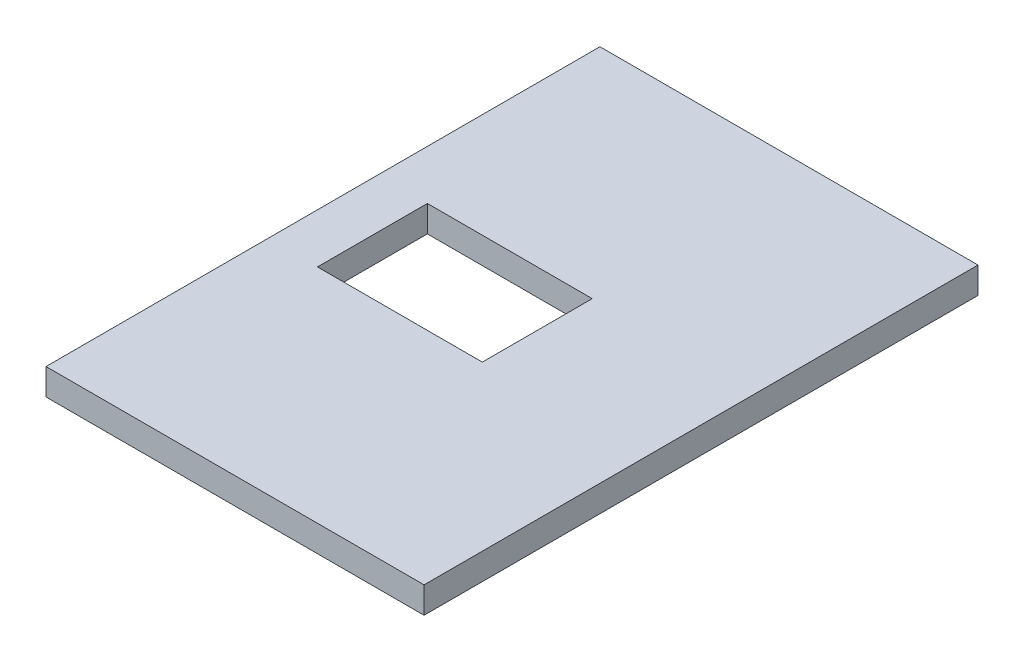
ISO-10303-21;
HEADER;
FILE_DESCRIPTION(('STEP AP214'),'2;1');
FILE_NAME('part.step','',(''),(''),'','','');
FILE_SCHEMA(('AUTOMOTIVE_DESIGN { 1 0 10303 214 1 1 1 1 }'));
ENDSEC;
DATA;
#1=APPLICATION_CONTEXT('core data for automotive mechanical design processes');
#2=APPLICATION_PROTOCOL_DEFINITION('international standard','automotive_design',2000,#1);
#3=PRODUCT_CONTEXT('',#1,'mechanical');
#4=PRODUCT('Part','Part','',(#3));
#5=PRODUCT_RELATED_PRODUCT_CATEGORY('part','',(#4));
#6=PRODUCT_DEFINITION_FORMATION('','',#4);
#7=PRODUCT_DEFINITION_CONTEXT('part definition',#1,'design');
#8=PRODUCT_DEFINITION('design','',#6,#7);
#9=PRODUCT_DEFINITION_SHAPE('','',#8);
#10=(LENGTH_UNIT() NAMED_UNIT(*) SI_UNIT(.MILLI.,.METRE.));
#11=(NAMED_UNIT(*) PLANE_ANGLE_UNIT() SI_UNIT($,.RADIAN.));
#12=(NAMED_UNIT(*) SI_UNIT($,.STERADIAN.) SOLID_ANGLE_UNIT());
#13=UNCERTAINTY_MEASURE_WITH_UNIT(LENGTH_MEASURE(1.E-05),#10,'distance_accuracy_value','');
#14=(GEOMETRIC_REPRESENTATION_CONTEXT(3) GLOBAL_UNCERTAINTY_ASSIGNED_CONTEXT((#13)) GLOBAL_UNIT_ASSIGNED_CONTEXT((#10,
#11,#12)) REPRESENTATION_CONTEXT('',''));
#15=CARTESIAN_POINT('',(0.,0.,0.));
#16=DIRECTION('',(0.,0.,1.));
#17=DIRECTION('',(1.,0.,0.));
#18=AXIS2_PLACEMENT_3D('',#15,#16,#17);
#19=CARTESIAN_POINT('',(810.,120.,1260.));
#20=DIRECTION('',(0.,0.,-1.));
#21=DIRECTION('',(-1.,0.,0.));
#22=AXIS2_PLACEMENT_3D('',#19,#20,#21);
#23=PLANE('',#22);
#24=DIRECTION('',(1.,0.,0.));
#25=VECTOR('',#24,1.);
#26=CARTESIAN_POINT('',(810.,0.,1260.));
#27=LINE('',#26,#25);
#28=CARTESIAN_POINT('',(-910.,0.,1260.));
#29=VERTEX_POINT('',#28);
#30=CARTESIAN_POINT('',(810.,0.,1260.));
#31=VERTEX_POINT('',#30);
#32=EDGE_CURVE('E114',#29,#31,#27,.T.);
#33=ORIENTED_EDGE('',*,*,#32,.T.);
#34=DIRECTION('',(0.,-1.,0.));
#35=VECTOR('',#34,1.);
#36=CARTESIAN_POINT('',(810.,120.,1260.));
#37=LINE('',#36,#35);
#38=CARTESIAN_POINT('',(810.,120.,1260.));
#39=VERTEX_POINT('',#38);
#40=EDGE_CURVE('E11',#39,#31,#37,.T.);
#41=ORIENTED_EDGE('',*,*,#40,.F.);
#42=DIRECTION('',(1.,0.,0.));
#43=VECTOR('',#42,1.);
#44=CARTESIAN_POINT('',(810.,120.,1260.));
#45=LINE('',#44,#43);
#46=CARTESIAN_POINT('',(-910.,120.,1260.));
#47=VERTEX_POINT('',#46);
#48=EDGE_CURVE('E108',#47,#39,#45,.T.);
#49=ORIENTED_EDGE('',*,*,#48,.F.);
#50=DIRECTION('',(0.,1.,0.));
#51=VECTOR('',#50,1.);
#52=CARTESIAN_POINT('',(-910.,120.,1260.));
#53=LINE('',#52,#51);
#54=EDGE_CURVE('E118',#29,#47,#53,.T.);
#55=ORIENTED_EDGE('',*,*,#54,.F.);
#56=EDGE_LOOP('',(#33,#41,#49,#55));
#57=FACE_BOUND('',#56,.T.);
#58=ADVANCED_FACE('F34',(#57),#23,.F.);
#59=CARTESIAN_POINT('',(810.,120.,-1260.));
#60=DIRECTION('',(-1.,0.,0.));
#61=DIRECTION('',(0.,0.,1.));
#62=AXIS2_PLACEMENT_3D('',#59,#60,#61);
#63=PLANE('',#62);
#64=DIRECTION('',(0.,0.,-1.));
#65=VECTOR('',#64,1.);
#66=CARTESIAN_POINT('',(810.,0.,-1260.));
#67=LINE('',#66,#65);
#68=CARTESIAN_POINT('',(810.,0.,-1260.));
#69=VERTEX_POINT('',#68);
#70=EDGE_CURVE('E109',#31,#69,#67,.T.);
#71=ORIENTED_EDGE('',*,*,#70,.T.);
#72=DIRECTION('',(0.,-1.,0.));
#73=VECTOR('',#72,1.);
#74=CARTESIAN_POINT('',(810.,120.,-1260.));
#75=LINE('',#74,#73);
#76=CARTESIAN_POINT('',(810.,120.,-1260.));
#77=VERTEX_POINT('',#76);
#78=EDGE_CURVE('E41',#77,#69,#75,.T.);
#79=ORIENTED_EDGE('',*,*,#78,.F.);
#80=DIRECTION('',(0.,0.,-1.));
#81=VECTOR('',#80,1.);
#82=CARTESIAN_POINT('',(810.,120.,-1260.));
#83=LINE('',#82,#81);
#84=EDGE_CURVE('E157',#39,#77,#83,.T.);
#85=ORIENTED_EDGE('',*,*,#84,.F.);
#86=ORIENTED_EDGE('',*,*,#40,.T.);
#87=EDGE_LOOP('',(#71,#79,#85,#86));
#88=FACE_BOUND('',#87,.T.);
#89=ADVANCED_FACE('F163',(#88),#63,.F.);
#90=CARTESIAN_POINT('',(810.,120.,-1260.));
#91=DIRECTION('',(0.,0.,1.));
#92=DIRECTION('',(1.,0.,0.));
#93=AXIS2_PLACEMENT_3D('',#90,#91,#92);
#94=PLANE('',#93);
#95=DIRECTION('',(-1.,0.,0.));
#96=VECTOR('',#95,1.);
#97=CARTESIAN_POINT('',(810.,0.,-1260.));
#98=LINE('',#97,#96);
#99=CARTESIAN_POINT('',(-910.,0.,-1260.));
#100=VERTEX_POINT('',#99);
#101=EDGE_CURVE('E99',#69,#100,#98,.T.);
#102=ORIENTED_EDGE('',*,*,#101,.T.);
#103=DIRECTION('',(0.,-1.,0.));
#104=VECTOR('',#103,1.);
#105=CARTESIAN_POINT('',(-910.,0.,-1260.));
#106=LINE('',#105,#104);
#107=CARTESIAN_POINT('',(-910.,120.,-1260.));
#108=VERTEX_POINT('',#107);
#109=EDGE_CURVE('E104',#108,#100,#106,.T.);
#110=ORIENTED_EDGE('',*,*,#109,.F.);
#111=DIRECTION('',(-1.,0.,0.));
#112=VECTOR('',#111,1.);
#113=CARTESIAN_POINT('',(810.,120.,-1260.));
#114=LINE('',#113,#112);
#115=EDGE_CURVE('E159',#77,#108,#114,.T.);
#116=ORIENTED_EDGE('',*,*,#115,.F.);
#117=ORIENTED_EDGE('',*,*,#78,.T.);
#118=EDGE_LOOP('',(#102,#110,#116,#117));
#119=FACE_BOUND('',#118,.T.);
#120=ADVANCED_FACE('F101',(#119),#94,.F.);
#121=CARTESIAN_POINT('',(0.,120.,0.));
#122=DIRECTION('',(0.,-1.,0.));
#123=DIRECTION('',(0.,0.,-1.));
#124=AXIS2_PLACEMENT_3D('',#121,#122,#123);
#125=PLANE('',#124);
#126=DIRECTION('',(-1.,0.,0.));
#127=VECTOR('',#126,1.);
#128=CARTESIAN_POINT('',(-685.,120.,-250.));
#129=LINE('',#128,#127);
#130=CARTESIAN_POINT('',(64.9999999999999,120.,-250.));
#131=VERTEX_POINT('',#130);
#132=CARTESIAN_POINT('',(-685.,120.,-250.));
#133=VERTEX_POINT('',#132);
#134=EDGE_CURVE('E141',#131,#133,#129,.T.);
#135=ORIENTED_EDGE('',*,*,#134,.F.);
#136=DIRECTION('',(0.,0.,-1.));
#137=VECTOR('',#136,1.);
#138=CARTESIAN_POINT('',(64.9999999999999,120.,250.));
#139=LINE('',#138,#137);
#140=CARTESIAN_POINT('',(64.9999999999999,120.,250.));
#141=VERTEX_POINT('',#140);
#142=EDGE_CURVE('E48',#141,#131,#139,.T.);
#143=ORIENTED_EDGE('',*,*,#142,.F.);
#144=DIRECTION('',(1.,0.,0.));
#145=VECTOR('',#144,1.);
#146=CARTESIAN_POINT('',(-685.,120.,250.));
#147=LINE('',#146,#145);
#148=CARTESIAN_POINT('',(-685.,120.,250.));
#149=VERTEX_POINT('',#148);
#150=EDGE_CURVE('E132',#149,#141,#147,.T.);
#151=ORIENTED_EDGE('',*,*,#150,.F.);
#152=DIRECTION('',(0.,0.,1.));
#153=VECTOR('',#152,1.);
#154=CARTESIAN_POINT('',(-685.,120.,250.));
#155=LINE('',#154,#153);
#156=EDGE_CURVE('E144',#133,#149,#155,.T.);
#157=ORIENTED_EDGE('',*,*,#156,.F.);
#158=EDGE_LOOP('',(#135,#143,#151,#157));
#159=FACE_BOUND('',#158,.T.);
#160=ORIENTED_EDGE('',*,*,#115,.T.);
#161=DIRECTION('',(0.,0.,-1.));
#162=VECTOR('',#161,1.);
#163=CARTESIAN_POINT('',(-910.,120.,-1260.));
#164=LINE('',#163,#162);
#165=EDGE_CURVE('E123',#47,#108,#164,.T.);
#166=ORIENTED_EDGE('',*,*,#165,.F.);
#167=ORIENTED_EDGE('',*,*,#48,.T.);
#168=ORIENTED_EDGE('',*,*,#84,.T.);
#169=EDGE_LOOP('',(#160,#166,#167,#168));
#170=FACE_BOUND('',#169,.T.);
#171=ADVANCED_FACE('F168',(#159,#170),#125,.F.);
#172=CARTESIAN_POINT('',(0.,0.,0.));
#173=DIRECTION('',(0.,-1.,0.));
#174=DIRECTION('',(0.,0.,-1.));
#175=AXIS2_PLACEMENT_3D('',#172,#173,#174);
#176=PLANE('',#175);
#177=DIRECTION('',(0.,0.,-1.));
#178=VECTOR('',#177,1.);
#179=CARTESIAN_POINT('',(64.9999999999999,0.,250.));
#180=LINE('',#179,#178);
#181=CARTESIAN_POINT('',(64.9999999999999,0.,250.));
#182=VERTEX_POINT('',#181);
#183=CARTESIAN_POINT('',(64.9999999999999,0.,-250.));
#184=VERTEX_POINT('',#183);
#185=EDGE_CURVE('E128',#182,#184,#180,.T.);
#186=ORIENTED_EDGE('',*,*,#185,.T.);
#187=DIRECTION('',(-1.,0.,0.));
#188=VECTOR('',#187,1.);
#189=CARTESIAN_POINT('',(-685.,0.,-250.));
#190=LINE('',#189,#188);
#191=CARTESIAN_POINT('',(-685.,0.,-250.));
#192=VERTEX_POINT('',#191);
#193=EDGE_CURVE('E131',#184,#192,#190,.T.);
#194=ORIENTED_EDGE('',*,*,#193,.T.);
#195=DIRECTION('',(0.,0.,1.));
#196=VECTOR('',#195,1.);
#197=CARTESIAN_POINT('',(-685.,0.,250.));
#198=LINE('',#197,#196);
#199=CARTESIAN_POINT('',(-685.,0.,250.));
#200=VERTEX_POINT('',#199);
#201=EDGE_CURVE('E56',#192,#200,#198,.T.);
#202=ORIENTED_EDGE('',*,*,#201,.T.);
#203=DIRECTION('',(1.,0.,0.));
#204=VECTOR('',#203,1.);
#205=CARTESIAN_POINT('',(-685.,0.,250.));
#206=LINE('',#205,#204);
#207=EDGE_CURVE('E136',#200,#182,#206,.T.);
#208=ORIENTED_EDGE('',*,*,#207,.T.);
#209=EDGE_LOOP('',(#186,#194,#202,#208));
#210=FACE_BOUND('',#209,.T.);
#211=ORIENTED_EDGE('',*,*,#32,.F.);
#212=DIRECTION('',(0.,0.,1.));
#213=VECTOR('',#212,1.);
#214=CARTESIAN_POINT('',(-910.,0.,1260.));
#215=LINE('',#214,#213);
#216=EDGE_CURVE('E112',#100,#29,#215,.T.);
#217=ORIENTED_EDGE('',*,*,#216,.F.);
#218=ORIENTED_EDGE('',*,*,#101,.F.);
#219=ORIENTED_EDGE('',*,*,#70,.F.);
#220=EDGE_LOOP('',(#211,#217,#218,#219));
#221=FACE_BOUND('',#220,.T.);
#222=ADVANCED_FACE('F113',(#210,#221),#176,.T.);
#223=CARTESIAN_POINT('',(64.9999999999999,0.,250.));
#224=DIRECTION('',(1.,0.,0.));
#225=DIRECTION('',(0.,0.,-1.));
#226=AXIS2_PLACEMENT_3D('',#223,#224,#225);
#227=PLANE('',#226);
#228=ORIENTED_EDGE('',*,*,#142,.T.);
#229=DIRECTION('',(0.,1.,0.));
#230=VECTOR('',#229,1.);
#231=CARTESIAN_POINT('',(64.9999999999999,0.,-250.));
#232=LINE('',#231,#230);
#233=EDGE_CURVE('E139',#184,#131,#232,.T.);
#234=ORIENTED_EDGE('',*,*,#233,.F.);
#235=ORIENTED_EDGE('',*,*,#185,.F.);
#236=DIRECTION('',(0.,1.,0.));
#237=VECTOR('',#236,1.);
#238=CARTESIAN_POINT('',(64.9999999999999,0.,250.));
#239=LINE('',#238,#237);
#240=EDGE_CURVE('E149',#182,#141,#239,.T.);
#241=ORIENTED_EDGE('',*,*,#240,.T.);
#242=EDGE_LOOP('',(#228,#234,#235,#241));
#243=FACE_BOUND('',#242,.T.);
#244=ADVANCED_FACE('F176',(#243),#227,.F.);
#245=CARTESIAN_POINT('',(-685.,0.,250.));
#246=DIRECTION('',(0.,0.,1.));
#247=DIRECTION('',(1.,0.,0.));
#248=AXIS2_PLACEMENT_3D('',#245,#246,#247);
#249=PLANE('',#248);
#250=ORIENTED_EDGE('',*,*,#150,.T.);
#251=ORIENTED_EDGE('',*,*,#240,.F.);
#252=ORIENTED_EDGE('',*,*,#207,.F.);
#253=DIRECTION('',(0.,1.,0.));
#254=VECTOR('',#253,1.);
#255=CARTESIAN_POINT('',(-685.,0.,250.));
#256=LINE('',#255,#254);
#257=EDGE_CURVE('E151',#200,#149,#256,.T.);
#258=ORIENTED_EDGE('',*,*,#257,.T.);
#259=EDGE_LOOP('',(#250,#251,#252,#258));
#260=FACE_BOUND('',#259,.T.);
#261=ADVANCED_FACE('F234',(#260),#249,.F.);
#262=CARTESIAN_POINT('',(-685.,0.,250.));
#263=DIRECTION('',(-1.,0.,0.));
#264=DIRECTION('',(0.,0.,1.));
#265=AXIS2_PLACEMENT_3D('',#262,#263,#264);
#266=PLANE('',#265);
#267=ORIENTED_EDGE('',*,*,#156,.T.);
#268=ORIENTED_EDGE('',*,*,#257,.F.);
#269=ORIENTED_EDGE('',*,*,#201,.F.);
#270=DIRECTION('',(0.,1.,0.));
#271=VECTOR('',#270,1.);
#272=CARTESIAN_POINT('',(-685.,0.,-250.));
#273=LINE('',#272,#271);
#274=EDGE_CURVE('E153',#192,#133,#273,.T.);
#275=ORIENTED_EDGE('',*,*,#274,.T.);
#276=EDGE_LOOP('',(#267,#268,#269,#275));
#277=FACE_BOUND('',#276,.T.);
#278=ADVANCED_FACE('F226',(#277),#266,.F.);
#279=CARTESIAN_POINT('',(-685.,0.,-250.));
#280=DIRECTION('',(0.,0.,-1.));
#281=DIRECTION('',(-1.,0.,0.));
#282=AXIS2_PLACEMENT_3D('',#279,#280,#281);
#283=PLANE('',#282);
#284=ORIENTED_EDGE('',*,*,#134,.T.);
#285=ORIENTED_EDGE('',*,*,#274,.F.);
#286=ORIENTED_EDGE('',*,*,#193,.F.);
#287=ORIENTED_EDGE('',*,*,#233,.T.);
#288=EDGE_LOOP('',(#284,#285,#286,#287));
#289=FACE_BOUND('',#288,.T.);
#290=ADVANCED_FACE('F218',(#289),#283,.F.);
#291=CARTESIAN_POINT('',(-910.,0.,0.));
#292=DIRECTION('',(1.,0.,0.));
#293=DIRECTION('',(0.,0.,-1.));
#294=AXIS2_PLACEMENT_3D('',#291,#292,#293);
#295=PLANE('',#294);
#296=ORIENTED_EDGE('',*,*,#109,.T.);
#297=ORIENTED_EDGE('',*,*,#216,.T.);
#298=ORIENTED_EDGE('',*,*,#54,.T.);
#299=ORIENTED_EDGE('',*,*,#165,.T.);
#300=EDGE_LOOP('',(#296,#297,#298,#299));
#301=FACE_BOUND('',#300,.T.);
#302=ADVANCED_FACE('F121',(#301),#295,.F.);
#303=CLOSED_SHELL('',(#58,#89,#120,#171,#222,#244,#261,#278,#290,#302));
#304=MANIFOLD_SOLID_BREP('B2',#303);
#305=ADVANCED_BREP_SHAPE_REPRESENTATION('',(#18,#304),#14);
#306=SHAPE_DEFINITION_REPRESENTATION(#9,#305);
ENDSEC;
END-ISO-10303-21;
